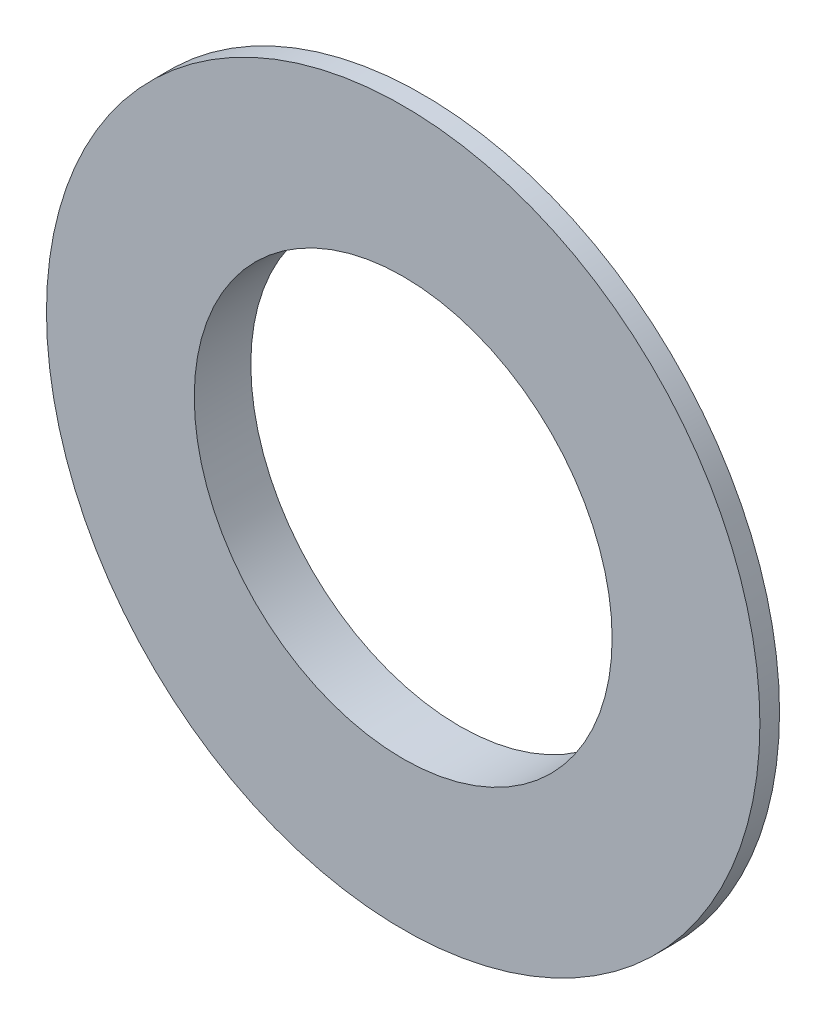
ISO-10303-21;
HEADER;
FILE_DESCRIPTION(('STEP AP214'),'2;1');
FILE_NAME('part.step','',(''),(''),'','','');
FILE_SCHEMA(('AUTOMOTIVE_DESIGN { 1 0 10303 214 1 1 1 1 }'));
ENDSEC;
DATA;
#1=APPLICATION_CONTEXT('core data for automotive mechanical design processes');
#2=APPLICATION_PROTOCOL_DEFINITION('international standard','automotive_design',2000,#1);
#3=PRODUCT_CONTEXT('',#1,'mechanical');
#4=PRODUCT('Part','Part','',(#3));
#5=PRODUCT_RELATED_PRODUCT_CATEGORY('part','',(#4));
#6=PRODUCT_DEFINITION_FORMATION('','',#4);
#7=PRODUCT_DEFINITION_CONTEXT('part definition',#1,'design');
#8=PRODUCT_DEFINITION('design','',#6,#7);
#9=PRODUCT_DEFINITION_SHAPE('','',#8);
#10=(LENGTH_UNIT() NAMED_UNIT(*) SI_UNIT(.MILLI.,.METRE.));
#11=(NAMED_UNIT(*) PLANE_ANGLE_UNIT() SI_UNIT($,.RADIAN.));
#12=(NAMED_UNIT(*) SI_UNIT($,.STERADIAN.) SOLID_ANGLE_UNIT());
#13=UNCERTAINTY_MEASURE_WITH_UNIT(LENGTH_MEASURE(1.E-05),#10,'distance_accuracy_value','');
#14=(GEOMETRIC_REPRESENTATION_CONTEXT(3) GLOBAL_UNCERTAINTY_ASSIGNED_CONTEXT((#13)) GLOBAL_UNIT_ASSIGNED_CONTEXT((#10,
#11,#12)) REPRESENTATION_CONTEXT('',''));
#15=CARTESIAN_POINT('',(0.,0.,0.));
#16=DIRECTION('',(0.,0.,1.));
#17=DIRECTION('',(1.,0.,0.));
#18=AXIS2_PLACEMENT_3D('',#15,#16,#17);
#19=CARTESIAN_POINT('',(-11.08,0.,0.));
#20=DIRECTION('',(0.,0.,-1.));
#21=DIRECTION('',(-1.,0.,0.));
#22=AXIS2_PLACEMENT_3D('',#19,#20,#21);
#23=PLANE('',#22);
#24=CARTESIAN_POINT('',(0.,0.,0.));
#25=DIRECTION('',(0.,0.,1.));
#26=DIRECTION('',(1.,0.,0.));
#27=AXIS2_PLACEMENT_3D('',#24,#25,#26);
#28=CIRCLE('',#27,11.08);
#29=CARTESIAN_POINT('',(11.08,0.,0.));
#30=VERTEX_POINT('',#29);
#31=EDGE_CURVE('E60',#30,#30,#28,.T.);
#32=ORIENTED_EDGE('',*,*,#31,.F.);
#33=EDGE_LOOP('',(#32));
#34=FACE_BOUND('',#33,.T.);
#35=CARTESIAN_POINT('',(0.,0.,0.));
#36=DIRECTION('',(0.,0.,1.));
#37=DIRECTION('',(1.,0.,0.));
#38=AXIS2_PLACEMENT_3D('',#35,#36,#37);
#39=CIRCLE('',#38,18.9167346938775);
#40=CARTESIAN_POINT('',(18.9167346938775,0.,0.));
#41=VERTEX_POINT('',#40);
#42=EDGE_CURVE('E10',#41,#41,#39,.T.);
#43=ORIENTED_EDGE('',*,*,#42,.T.);
#44=EDGE_LOOP('',(#43));
#45=FACE_BOUND('',#44,.T.);
#46=ADVANCED_FACE('F43',(#34,#45),#23,.F.);
#47=CARTESIAN_POINT('',(0.,0.,0.));
#48=DIRECTION('',(0.,0.,1.));
#49=DIRECTION('',(1.,0.,0.));
#50=AXIS2_PLACEMENT_3D('',#47,#48,#49);
#51=CYLINDRICAL_SURFACE('',#50,18.9167346938775);
#52=ORIENTED_EDGE('',*,*,#42,.F.);
#53=EDGE_LOOP('',(#52));
#54=FACE_BOUND('',#53,.T.);
#55=CARTESIAN_POINT('',(0.,0.,-1.0408163265306));
#56=DIRECTION('',(0.,0.,1.));
#57=DIRECTION('',(1.,0.,0.));
#58=AXIS2_PLACEMENT_3D('',#55,#56,#57);
#59=CIRCLE('',#58,18.9167346938775);
#60=CARTESIAN_POINT('',(18.9167346938775,0.,-1.0408163265306));
#61=VERTEX_POINT('',#60);
#62=EDGE_CURVE('E50',#61,#61,#59,.T.);
#63=ORIENTED_EDGE('',*,*,#62,.T.);
#64=EDGE_LOOP('',(#63));
#65=FACE_BOUND('',#64,.T.);
#66=ADVANCED_FACE('F70',(#54,#65),#51,.T.);
#67=CARTESIAN_POINT('',(0.,0.,-3.));
#68=DIRECTION('',(0.,0.,1.));
#69=DIRECTION('',(1.,0.,0.));
#70=AXIS2_PLACEMENT_3D('',#67,#68,#69);
#71=CONICAL_SURFACE('',#70,11.08,1.32581766366803);
#72=ORIENTED_EDGE('',*,*,#62,.F.);
#73=EDGE_LOOP('',(#72));
#74=FACE_BOUND('',#73,.T.);
#75=CARTESIAN_POINT('',(0.,0.,-3.));
#76=DIRECTION('',(0.,0.,1.));
#77=DIRECTION('',(1.,0.,0.));
#78=AXIS2_PLACEMENT_3D('',#75,#76,#77);
#79=CIRCLE('',#78,11.08);
#80=CARTESIAN_POINT('',(11.08,0.,-3.));
#81=VERTEX_POINT('',#80);
#82=EDGE_CURVE('E55',#81,#81,#79,.T.);
#83=ORIENTED_EDGE('',*,*,#82,.T.);
#84=EDGE_LOOP('',(#83));
#85=FACE_BOUND('',#84,.T.);
#86=ADVANCED_FACE('F74',(#74,#85),#71,.T.);
#87=CARTESIAN_POINT('',(0.,0.,0.));
#88=DIRECTION('',(0.,0.,1.));
#89=DIRECTION('',(1.,0.,0.));
#90=AXIS2_PLACEMENT_3D('',#87,#88,#89);
#91=CYLINDRICAL_SURFACE('',#90,11.08);
#92=ORIENTED_EDGE('',*,*,#82,.F.);
#93=EDGE_LOOP('',(#92));
#94=FACE_BOUND('',#93,.T.);
#95=ORIENTED_EDGE('',*,*,#31,.T.);
#96=EDGE_LOOP('',(#95));
#97=FACE_BOUND('',#96,.T.);
#98=ADVANCED_FACE('F67',(#94,#97),#91,.F.);
#99=CLOSED_SHELL('',(#46,#66,#86,#98));
#100=MANIFOLD_SOLID_BREP('B2',#99);
#101=ADVANCED_BREP_SHAPE_REPRESENTATION('',(#18,#100),#14);
#102=SHAPE_DEFINITION_REPRESENTATION(#9,#101);
ENDSEC;
END-ISO-10303-21;
